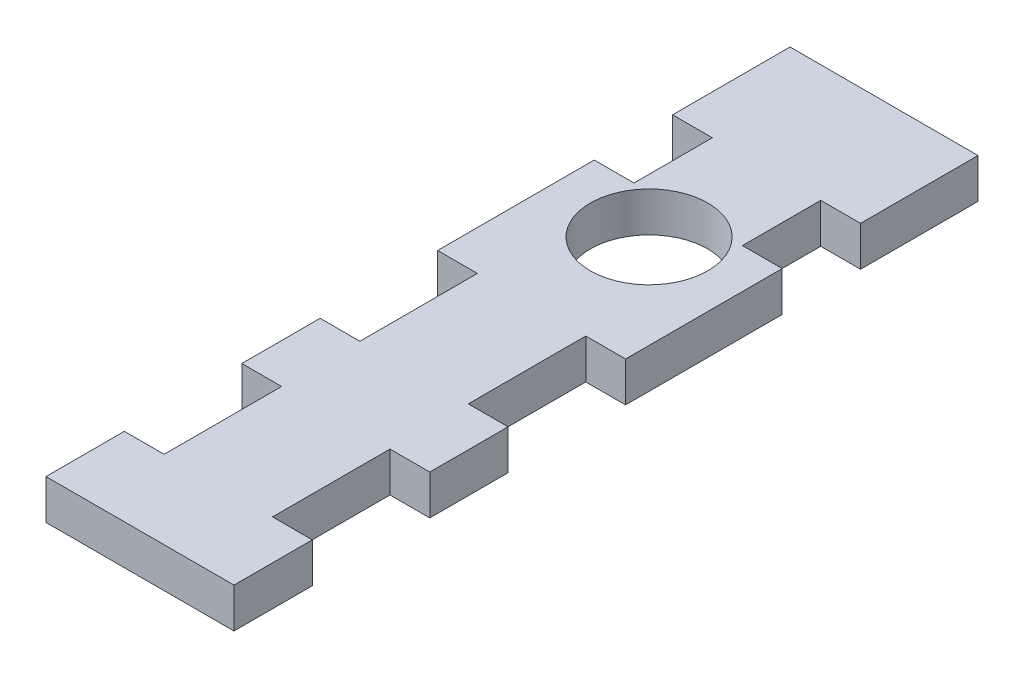
ISO-10303-21;
HEADER;
FILE_DESCRIPTION(('STEP AP214'),'2;1');
FILE_NAME('part.step','',(''),(''),'','','');
FILE_SCHEMA(('AUTOMOTIVE_DESIGN { 1 0 10303 214 1 1 1 1 }'));
ENDSEC;
DATA;
#1=APPLICATION_CONTEXT('core data for automotive mechanical design processes');
#2=APPLICATION_PROTOCOL_DEFINITION('international standard','automotive_design',2000,#1);
#3=PRODUCT_CONTEXT('',#1,'mechanical');
#4=PRODUCT('Part','Part','',(#3));
#5=PRODUCT_RELATED_PRODUCT_CATEGORY('part','',(#4));
#6=PRODUCT_DEFINITION_FORMATION('','',#4);
#7=PRODUCT_DEFINITION_CONTEXT('part definition',#1,'design');
#8=PRODUCT_DEFINITION('design','',#6,#7);
#9=PRODUCT_DEFINITION_SHAPE('','',#8);
#10=(LENGTH_UNIT() NAMED_UNIT(*) SI_UNIT(.MILLI.,.METRE.));
#11=(NAMED_UNIT(*) PLANE_ANGLE_UNIT() SI_UNIT($,.RADIAN.));
#12=(NAMED_UNIT(*) SI_UNIT($,.STERADIAN.) SOLID_ANGLE_UNIT());
#13=UNCERTAINTY_MEASURE_WITH_UNIT(LENGTH_MEASURE(1.E-05),#10,'distance_accuracy_value','');
#14=(GEOMETRIC_REPRESENTATION_CONTEXT(3) GLOBAL_UNCERTAINTY_ASSIGNED_CONTEXT((#13)) GLOBAL_UNIT_ASSIGNED_CONTEXT((#10,
#11,#12)) REPRESENTATION_CONTEXT('',''));
#15=CARTESIAN_POINT('',(0.,0.,0.));
#16=DIRECTION('',(0.,0.,1.));
#17=DIRECTION('',(1.,0.,0.));
#18=AXIS2_PLACEMENT_3D('',#15,#16,#17);
#19=CARTESIAN_POINT('',(0.,5.08,0.));
#20=DIRECTION('',(0.,-1.,0.));
#21=DIRECTION('',(0.,0.,-1.));
#22=AXIS2_PLACEMENT_3D('',#19,#20,#21);
#23=PLANE('',#22);
#24=CARTESIAN_POINT('',(0.,5.08,-32.5));
#25=DIRECTION('',(0.,1.,0.));
#26=DIRECTION('',(0.,0.,1.));
#27=AXIS2_PLACEMENT_3D('',#24,#25,#26);
#28=CIRCLE('',#27,7.5);
#29=CARTESIAN_POINT('',(0.,5.08,-25.));
#30=VERTEX_POINT('',#29);
#31=EDGE_CURVE('E381',#30,#30,#28,.T.);
#32=ORIENTED_EDGE('',*,*,#31,.F.);
#33=EDGE_LOOP('',(#32));
#34=FACE_BOUND('',#33,.T.);
#35=DIRECTION('',(-1.,0.,0.));
#36=VECTOR('',#35,1.);
#37=CARTESIAN_POINT('',(12.,5.08,-2.50000000000002));
#38=LINE('',#37,#36);
#39=CARTESIAN_POINT('',(12.,5.08,-2.50000000000002));
#40=VERTEX_POINT('',#39);
#41=CARTESIAN_POINT('',(6.92,5.08,-2.50000000000002));
#42=VERTEX_POINT('',#41);
#43=EDGE_CURVE('E247',#40,#42,#38,.T.);
#44=ORIENTED_EDGE('',*,*,#43,.T.);
#45=DIRECTION('',(0.,0.,-1.));
#46=VECTOR('',#45,1.);
#47=CARTESIAN_POINT('',(6.92,5.08,-2.50000000000002));
#48=LINE('',#47,#46);
#49=CARTESIAN_POINT('',(6.92,5.08,-17.5));
#50=VERTEX_POINT('',#49);
#51=EDGE_CURVE('E224',#42,#50,#48,.T.);
#52=ORIENTED_EDGE('',*,*,#51,.T.);
#53=DIRECTION('',(1.,0.,0.));
#54=VECTOR('',#53,1.);
#55=CARTESIAN_POINT('',(12.,5.08,-17.5));
#56=LINE('',#55,#54);
#57=CARTESIAN_POINT('',(12.,5.08,-17.5));
#58=VERTEX_POINT('',#57);
#59=EDGE_CURVE('E220',#50,#58,#56,.T.);
#60=ORIENTED_EDGE('',*,*,#59,.T.);
#61=DIRECTION('',(0.,0.,-1.));
#62=VECTOR('',#61,1.);
#63=CARTESIAN_POINT('',(12.,5.08,32.5));
#64=LINE('',#63,#62);
#65=CARTESIAN_POINT('',(12.,5.08,-37.5));
#66=VERTEX_POINT('',#65);
#67=EDGE_CURVE('E401',#58,#66,#64,.T.);
#68=ORIENTED_EDGE('',*,*,#67,.T.);
#69=DIRECTION('',(-1.,0.,0.));
#70=VECTOR('',#69,1.);
#71=CARTESIAN_POINT('',(12.,5.08,-37.5));
#72=LINE('',#71,#70);
#73=CARTESIAN_POINT('',(6.92,5.08,-37.5));
#74=VERTEX_POINT('',#73);
#75=EDGE_CURVE('E251',#66,#74,#72,.T.);
#76=ORIENTED_EDGE('',*,*,#75,.T.);
#77=DIRECTION('',(0.,0.,-1.));
#78=VECTOR('',#77,1.);
#79=CARTESIAN_POINT('',(6.92,5.08,-37.5));
#80=LINE('',#79,#78);
#81=CARTESIAN_POINT('',(6.92,5.08,-47.5));
#82=VERTEX_POINT('',#81);
#83=EDGE_CURVE('E256',#74,#82,#80,.T.);
#84=ORIENTED_EDGE('',*,*,#83,.T.);
#85=DIRECTION('',(1.,0.,0.));
#86=VECTOR('',#85,1.);
#87=CARTESIAN_POINT('',(12.,5.08,-47.5));
#88=LINE('',#87,#86);
#89=CARTESIAN_POINT('',(12.,5.08,-47.5));
#90=VERTEX_POINT('',#89);
#91=EDGE_CURVE('E260',#82,#90,#88,.T.);
#92=ORIENTED_EDGE('',*,*,#91,.T.);
#93=CARTESIAN_POINT('',(12.,5.08,-62.5));
#94=VERTEX_POINT('',#93);
#95=EDGE_CURVE('E395',#90,#94,#64,.T.);
#96=ORIENTED_EDGE('',*,*,#95,.T.);
#97=DIRECTION('',(-1.,0.,0.));
#98=VECTOR('',#97,1.);
#99=CARTESIAN_POINT('',(12.,5.08,-62.5));
#100=LINE('',#99,#98);
#101=CARTESIAN_POINT('',(-12.,5.08,-62.5));
#102=VERTEX_POINT('',#101);
#103=EDGE_CURVE('E399',#94,#102,#100,.T.);
#104=ORIENTED_EDGE('',*,*,#103,.T.);
#105=DIRECTION('',(0.,0.,1.));
#106=VECTOR('',#105,1.);
#107=CARTESIAN_POINT('',(-12.,5.08,-62.5));
#108=LINE('',#107,#106);
#109=CARTESIAN_POINT('',(-12.,5.08,-47.5));
#110=VERTEX_POINT('',#109);
#111=EDGE_CURVE('E387',#102,#110,#108,.T.);
#112=ORIENTED_EDGE('',*,*,#111,.T.);
#113=DIRECTION('',(-1.,0.,0.));
#114=VECTOR('',#113,1.);
#115=CARTESIAN_POINT('',(-12.,5.08,-47.5));
#116=LINE('',#115,#114);
#117=CARTESIAN_POINT('',(-6.92,5.08,-47.5));
#118=VERTEX_POINT('',#117);
#119=EDGE_CURVE('E328',#118,#110,#116,.T.);
#120=ORIENTED_EDGE('',*,*,#119,.F.);
#121=DIRECTION('',(0.,0.,-1.));
#122=VECTOR('',#121,1.);
#123=CARTESIAN_POINT('',(-6.92,5.08,-37.5));
#124=LINE('',#123,#122);
#125=CARTESIAN_POINT('',(-6.92,5.08,-37.5));
#126=VERTEX_POINT('',#125);
#127=EDGE_CURVE('E331',#126,#118,#124,.T.);
#128=ORIENTED_EDGE('',*,*,#127,.F.);
#129=DIRECTION('',(1.,0.,0.));
#130=VECTOR('',#129,1.);
#131=CARTESIAN_POINT('',(-12.,5.08,-37.5));
#132=LINE('',#131,#130);
#133=CARTESIAN_POINT('',(-12.,5.08,-37.5));
#134=VERTEX_POINT('',#133);
#135=EDGE_CURVE('E327',#134,#126,#132,.T.);
#136=ORIENTED_EDGE('',*,*,#135,.F.);
#137=CARTESIAN_POINT('',(-12.,5.08,-17.5));
#138=VERTEX_POINT('',#137);
#139=EDGE_CURVE('E391',#134,#138,#108,.T.);
#140=ORIENTED_EDGE('',*,*,#139,.T.);
#141=DIRECTION('',(-1.,0.,0.));
#142=VECTOR('',#141,1.);
#143=CARTESIAN_POINT('',(-12.,5.08,-17.5));
#144=LINE('',#143,#142);
#145=CARTESIAN_POINT('',(-6.92,5.08,-17.5));
#146=VERTEX_POINT('',#145);
#147=EDGE_CURVE('E302',#146,#138,#144,.T.);
#148=ORIENTED_EDGE('',*,*,#147,.F.);
#149=DIRECTION('',(0.,0.,-1.));
#150=VECTOR('',#149,1.);
#151=CARTESIAN_POINT('',(-6.92,5.08,-2.50000000000002));
#152=LINE('',#151,#150);
#153=CARTESIAN_POINT('',(-6.92,5.08,-2.50000000000002));
#154=VERTEX_POINT('',#153);
#155=EDGE_CURVE('E305',#154,#146,#152,.T.);
#156=ORIENTED_EDGE('',*,*,#155,.F.);
#157=DIRECTION('',(1.,0.,0.));
#158=VECTOR('',#157,1.);
#159=CARTESIAN_POINT('',(-12.,5.08,-2.50000000000002));
#160=LINE('',#159,#158);
#161=CARTESIAN_POINT('',(-12.,5.08,-2.50000000000002));
#162=VERTEX_POINT('',#161);
#163=EDGE_CURVE('E292',#162,#154,#160,.T.);
#164=ORIENTED_EDGE('',*,*,#163,.F.);
#165=CARTESIAN_POINT('',(-12.,5.08,7.49999999999998));
#166=VERTEX_POINT('',#165);
#167=EDGE_CURVE('E392',#162,#166,#108,.T.);
#168=ORIENTED_EDGE('',*,*,#167,.T.);
#169=DIRECTION('',(-1.,0.,0.));
#170=VECTOR('',#169,1.);
#171=CARTESIAN_POINT('',(-12.,5.08,7.49999999999998));
#172=LINE('',#171,#170);
#173=CARTESIAN_POINT('',(-6.92,5.08,7.49999999999998));
#174=VERTEX_POINT('',#173);
#175=EDGE_CURVE('E354',#174,#166,#172,.T.);
#176=ORIENTED_EDGE('',*,*,#175,.F.);
#177=DIRECTION('',(0.,0.,-1.));
#178=VECTOR('',#177,1.);
#179=CARTESIAN_POINT('',(-6.92,5.08,22.5));
#180=LINE('',#179,#178);
#181=CARTESIAN_POINT('',(-6.92,5.08,22.5));
#182=VERTEX_POINT('',#181);
#183=EDGE_CURVE('E358',#182,#174,#180,.T.);
#184=ORIENTED_EDGE('',*,*,#183,.F.);
#185=DIRECTION('',(1.,0.,0.));
#186=VECTOR('',#185,1.);
#187=CARTESIAN_POINT('',(-12.,5.08,22.5));
#188=LINE('',#187,#186);
#189=CARTESIAN_POINT('',(-12.,5.08,22.5));
#190=VERTEX_POINT('',#189);
#191=EDGE_CURVE('E353',#190,#182,#188,.T.);
#192=ORIENTED_EDGE('',*,*,#191,.F.);
#193=CARTESIAN_POINT('',(-12.,5.08,32.5));
#194=VERTEX_POINT('',#193);
#195=EDGE_CURVE('E393',#190,#194,#108,.T.);
#196=ORIENTED_EDGE('',*,*,#195,.T.);
#197=DIRECTION('',(1.,0.,0.));
#198=VECTOR('',#197,1.);
#199=CARTESIAN_POINT('',(12.,5.08,32.5));
#200=LINE('',#199,#198);
#201=CARTESIAN_POINT('',(12.,5.08,32.5));
#202=VERTEX_POINT('',#201);
#203=EDGE_CURVE('E390',#194,#202,#200,.T.);
#204=ORIENTED_EDGE('',*,*,#203,.T.);
#205=CARTESIAN_POINT('',(12.,5.08,22.5));
#206=VERTEX_POINT('',#205);
#207=EDGE_CURVE('E396',#202,#206,#64,.T.);
#208=ORIENTED_EDGE('',*,*,#207,.T.);
#209=DIRECTION('',(-1.,0.,0.));
#210=VECTOR('',#209,1.);
#211=CARTESIAN_POINT('',(12.,5.08,22.5));
#212=LINE('',#211,#210);
#213=CARTESIAN_POINT('',(6.92,5.08,22.5));
#214=VERTEX_POINT('',#213);
#215=EDGE_CURVE('E276',#206,#214,#212,.T.);
#216=ORIENTED_EDGE('',*,*,#215,.T.);
#217=DIRECTION('',(0.,0.,-1.));
#218=VECTOR('',#217,1.);
#219=CARTESIAN_POINT('',(6.92,5.08,22.5));
#220=LINE('',#219,#218);
#221=CARTESIAN_POINT('',(6.92,5.08,7.49999999999998));
#222=VERTEX_POINT('',#221);
#223=EDGE_CURVE('E281',#214,#222,#220,.T.);
#224=ORIENTED_EDGE('',*,*,#223,.T.);
#225=DIRECTION('',(1.,0.,0.));
#226=VECTOR('',#225,1.);
#227=CARTESIAN_POINT('',(12.,5.08,7.49999999999998));
#228=LINE('',#227,#226);
#229=CARTESIAN_POINT('',(12.,5.08,7.49999999999998));
#230=VERTEX_POINT('',#229);
#231=EDGE_CURVE('E285',#222,#230,#228,.T.);
#232=ORIENTED_EDGE('',*,*,#231,.T.);
#233=EDGE_CURVE('E400',#230,#40,#64,.T.);
#234=ORIENTED_EDGE('',*,*,#233,.T.);
#235=EDGE_LOOP('',(#44,#52,#60,#68,#76,#84,#92,#96,#104,#112,#120,#128,#136,#140,#148,#156,#164,
#168,#176,#184,#192,#196,#204,#208,#216,#224,#232,#234));
#236=FACE_BOUND('',#235,.T.);
#237=ADVANCED_FACE('F33',(#34,#236),#23,.F.);
#238=CARTESIAN_POINT('',(0.,0.,0.));
#239=DIRECTION('',(0.,-1.,0.));
#240=DIRECTION('',(0.,0.,-1.));
#241=AXIS2_PLACEMENT_3D('',#238,#239,#240);
#242=PLANE('',#241);
#243=CARTESIAN_POINT('',(0.,0.,-32.5));
#244=DIRECTION('',(0.,1.,0.));
#245=DIRECTION('',(0.,0.,1.));
#246=AXIS2_PLACEMENT_3D('',#243,#244,#245);
#247=CIRCLE('',#246,7.5);
#248=CARTESIAN_POINT('',(0.,0.,-25.));
#249=VERTEX_POINT('',#248);
#250=EDGE_CURVE('E380',#249,#249,#247,.T.);
#251=ORIENTED_EDGE('',*,*,#250,.T.);
#252=EDGE_LOOP('',(#251));
#253=FACE_BOUND('',#252,.T.);
#254=DIRECTION('',(0.,0.,-1.));
#255=VECTOR('',#254,1.);
#256=CARTESIAN_POINT('',(6.92,0.,-2.50000000000002));
#257=LINE('',#256,#255);
#258=CARTESIAN_POINT('',(6.92,0.,-2.50000000000002));
#259=VERTEX_POINT('',#258);
#260=CARTESIAN_POINT('',(6.92,0.,-17.5));
#261=VERTEX_POINT('',#260);
#262=EDGE_CURVE('E227',#259,#261,#257,.T.);
#263=ORIENTED_EDGE('',*,*,#262,.F.);
#264=DIRECTION('',(-1.,0.,0.));
#265=VECTOR('',#264,1.);
#266=CARTESIAN_POINT('',(12.,0.,-2.50000000000002));
#267=LINE('',#266,#265);
#268=CARTESIAN_POINT('',(12.,0.,-2.50000000000002));
#269=VERTEX_POINT('',#268);
#270=EDGE_CURVE('E234',#269,#259,#267,.T.);
#271=ORIENTED_EDGE('',*,*,#270,.F.);
#272=DIRECTION('',(0.,0.,-1.));
#273=VECTOR('',#272,1.);
#274=CARTESIAN_POINT('',(12.,0.,-32.5));
#275=LINE('',#274,#273);
#276=CARTESIAN_POINT('',(12.,0.,7.49999999999998));
#277=VERTEX_POINT('',#276);
#278=EDGE_CURVE('E417',#277,#269,#275,.T.);
#279=ORIENTED_EDGE('',*,*,#278,.F.);
#280=DIRECTION('',(1.,0.,0.));
#281=VECTOR('',#280,1.);
#282=CARTESIAN_POINT('',(12.,0.,7.49999999999998));
#283=LINE('',#282,#281);
#284=CARTESIAN_POINT('',(6.92,0.,7.49999999999998));
#285=VERTEX_POINT('',#284);
#286=EDGE_CURVE('E288',#285,#277,#283,.T.);
#287=ORIENTED_EDGE('',*,*,#286,.F.);
#288=DIRECTION('',(0.,0.,-1.));
#289=VECTOR('',#288,1.);
#290=CARTESIAN_POINT('',(6.92,0.,22.5));
#291=LINE('',#290,#289);
#292=CARTESIAN_POINT('',(6.92,0.,22.5));
#293=VERTEX_POINT('',#292);
#294=EDGE_CURVE('E289',#293,#285,#291,.T.);
#295=ORIENTED_EDGE('',*,*,#294,.F.);
#296=DIRECTION('',(-1.,0.,0.));
#297=VECTOR('',#296,1.);
#298=CARTESIAN_POINT('',(12.,0.,22.5));
#299=LINE('',#298,#297);
#300=CARTESIAN_POINT('',(12.,0.,22.5));
#301=VERTEX_POINT('',#300);
#302=EDGE_CURVE('E293',#301,#293,#299,.T.);
#303=ORIENTED_EDGE('',*,*,#302,.F.);
#304=CARTESIAN_POINT('',(12.,0.,32.5));
#305=VERTEX_POINT('',#304);
#306=EDGE_CURVE('E413',#305,#301,#275,.T.);
#307=ORIENTED_EDGE('',*,*,#306,.F.);
#308=DIRECTION('',(1.,0.,0.));
#309=VECTOR('',#308,1.);
#310=CARTESIAN_POINT('',(12.,0.,32.5));
#311=LINE('',#310,#309);
#312=CARTESIAN_POINT('',(-12.,0.,32.5));
#313=VERTEX_POINT('',#312);
#314=EDGE_CURVE('E407',#313,#305,#311,.T.);
#315=ORIENTED_EDGE('',*,*,#314,.F.);
#316=DIRECTION('',(0.,0.,1.));
#317=VECTOR('',#316,1.);
#318=CARTESIAN_POINT('',(-12.,0.,32.5));
#319=LINE('',#318,#317);
#320=CARTESIAN_POINT('',(-12.,0.,22.5));
#321=VERTEX_POINT('',#320);
#322=EDGE_CURVE('E384',#321,#313,#319,.T.);
#323=ORIENTED_EDGE('',*,*,#322,.F.);
#324=DIRECTION('',(1.,0.,0.));
#325=VECTOR('',#324,1.);
#326=CARTESIAN_POINT('',(-12.,0.,22.5));
#327=LINE('',#326,#325);
#328=CARTESIAN_POINT('',(-6.92,0.,22.5));
#329=VERTEX_POINT('',#328);
#330=EDGE_CURVE('E357',#321,#329,#327,.T.);
#331=ORIENTED_EDGE('',*,*,#330,.T.);
#332=DIRECTION('',(0.,0.,-1.));
#333=VECTOR('',#332,1.);
#334=CARTESIAN_POINT('',(-6.92,0.,22.5));
#335=LINE('',#334,#333);
#336=CARTESIAN_POINT('',(-6.92,0.,7.49999999999998));
#337=VERTEX_POINT('',#336);
#338=EDGE_CURVE('E371',#329,#337,#335,.T.);
#339=ORIENTED_EDGE('',*,*,#338,.T.);
#340=DIRECTION('',(-1.,0.,0.));
#341=VECTOR('',#340,1.);
#342=CARTESIAN_POINT('',(-12.,0.,7.49999999999998));
#343=LINE('',#342,#341);
#344=CARTESIAN_POINT('',(-12.,0.,7.49999999999998));
#345=VERTEX_POINT('',#344);
#346=EDGE_CURVE('E366',#337,#345,#343,.T.);
#347=ORIENTED_EDGE('',*,*,#346,.T.);
#348=CARTESIAN_POINT('',(-12.,0.,-2.50000000000002));
#349=VERTEX_POINT('',#348);
#350=EDGE_CURVE('E409',#349,#345,#319,.T.);
#351=ORIENTED_EDGE('',*,*,#350,.F.);
#352=DIRECTION('',(1.,0.,0.));
#353=VECTOR('',#352,1.);
#354=CARTESIAN_POINT('',(-12.,0.,-2.50000000000002));
#355=LINE('',#354,#353);
#356=CARTESIAN_POINT('',(-6.92,0.,-2.50000000000002));
#357=VERTEX_POINT('',#356);
#358=EDGE_CURVE('E304',#349,#357,#355,.T.);
#359=ORIENTED_EDGE('',*,*,#358,.T.);
#360=DIRECTION('',(0.,0.,-1.));
#361=VECTOR('',#360,1.);
#362=CARTESIAN_POINT('',(-6.92,0.,-2.50000000000002));
#363=LINE('',#362,#361);
#364=CARTESIAN_POINT('',(-6.92,0.,-17.5));
#365=VERTEX_POINT('',#364);
#366=EDGE_CURVE('E318',#357,#365,#363,.T.);
#367=ORIENTED_EDGE('',*,*,#366,.T.);
#368=DIRECTION('',(-1.,0.,0.));
#369=VECTOR('',#368,1.);
#370=CARTESIAN_POINT('',(-12.,0.,-17.5));
#371=LINE('',#370,#369);
#372=CARTESIAN_POINT('',(-12.,0.,-17.5));
#373=VERTEX_POINT('',#372);
#374=EDGE_CURVE('E313',#365,#373,#371,.T.);
#375=ORIENTED_EDGE('',*,*,#374,.T.);
#376=CARTESIAN_POINT('',(-12.,0.,-37.5));
#377=VERTEX_POINT('',#376);
#378=EDGE_CURVE('E408',#377,#373,#319,.T.);
#379=ORIENTED_EDGE('',*,*,#378,.F.);
#380=DIRECTION('',(1.,0.,0.));
#381=VECTOR('',#380,1.);
#382=CARTESIAN_POINT('',(-12.,0.,-37.5));
#383=LINE('',#382,#381);
#384=CARTESIAN_POINT('',(-6.92,0.,-37.5));
#385=VERTEX_POINT('',#384);
#386=EDGE_CURVE('E330',#377,#385,#383,.T.);
#387=ORIENTED_EDGE('',*,*,#386,.T.);
#388=DIRECTION('',(0.,0.,-1.));
#389=VECTOR('',#388,1.);
#390=CARTESIAN_POINT('',(-6.92,0.,-37.5));
#391=LINE('',#390,#389);
#392=CARTESIAN_POINT('',(-6.92,0.,-47.5));
#393=VERTEX_POINT('',#392);
#394=EDGE_CURVE('E344',#385,#393,#391,.T.);
#395=ORIENTED_EDGE('',*,*,#394,.T.);
#396=DIRECTION('',(-1.,0.,0.));
#397=VECTOR('',#396,1.);
#398=CARTESIAN_POINT('',(-12.,0.,-47.5));
#399=LINE('',#398,#397);
#400=CARTESIAN_POINT('',(-12.,0.,-47.5));
#401=VERTEX_POINT('',#400);
#402=EDGE_CURVE('E339',#393,#401,#399,.T.);
#403=ORIENTED_EDGE('',*,*,#402,.T.);
#404=CARTESIAN_POINT('',(-12.,0.,-62.5));
#405=VERTEX_POINT('',#404);
#406=EDGE_CURVE('E404',#405,#401,#319,.T.);
#407=ORIENTED_EDGE('',*,*,#406,.F.);
#408=DIRECTION('',(-1.,0.,0.));
#409=VECTOR('',#408,1.);
#410=CARTESIAN_POINT('',(12.,0.,-62.5));
#411=LINE('',#410,#409);
#412=CARTESIAN_POINT('',(12.,0.,-62.5));
#413=VERTEX_POINT('',#412);
#414=EDGE_CURVE('E416',#413,#405,#411,.T.);
#415=ORIENTED_EDGE('',*,*,#414,.F.);
#416=CARTESIAN_POINT('',(12.,0.,-47.5));
#417=VERTEX_POINT('',#416);
#418=EDGE_CURVE('E412',#417,#413,#275,.T.);
#419=ORIENTED_EDGE('',*,*,#418,.F.);
#420=DIRECTION('',(1.,0.,0.));
#421=VECTOR('',#420,1.);
#422=CARTESIAN_POINT('',(12.,0.,-47.5));
#423=LINE('',#422,#421);
#424=CARTESIAN_POINT('',(6.92,0.,-47.5));
#425=VERTEX_POINT('',#424);
#426=EDGE_CURVE('E56',#425,#417,#423,.T.);
#427=ORIENTED_EDGE('',*,*,#426,.F.);
#428=DIRECTION('',(0.,0.,-1.));
#429=VECTOR('',#428,1.);
#430=CARTESIAN_POINT('',(6.92,0.,-37.5));
#431=LINE('',#430,#429);
#432=CARTESIAN_POINT('',(6.92,0.,-37.5));
#433=VERTEX_POINT('',#432);
#434=EDGE_CURVE('E263',#433,#425,#431,.T.);
#435=ORIENTED_EDGE('',*,*,#434,.F.);
#436=DIRECTION('',(-1.,0.,0.));
#437=VECTOR('',#436,1.);
#438=CARTESIAN_POINT('',(12.,0.,-37.5));
#439=LINE('',#438,#437);
#440=CARTESIAN_POINT('',(12.,0.,-37.5));
#441=VERTEX_POINT('',#440);
#442=EDGE_CURVE('E267',#441,#433,#439,.T.);
#443=ORIENTED_EDGE('',*,*,#442,.F.);
#444=CARTESIAN_POINT('',(12.,0.,-17.5));
#445=VERTEX_POINT('',#444);
#446=EDGE_CURVE('E239',#445,#441,#275,.T.);
#447=ORIENTED_EDGE('',*,*,#446,.F.);
#448=DIRECTION('',(1.,0.,0.));
#449=VECTOR('',#448,1.);
#450=CARTESIAN_POINT('',(12.,0.,-17.5));
#451=LINE('',#450,#449);
#452=EDGE_CURVE('E48',#261,#445,#451,.T.);
#453=ORIENTED_EDGE('',*,*,#452,.F.);
#454=EDGE_LOOP('',(#263,#271,#279,#287,#295,#303,#307,#315,#323,#331,#339,#347,#351,#359,#367,
#375,#379,#387,#395,#403,#407,#415,#419,#427,#435,#443,#447,#453));
#455=FACE_BOUND('',#454,.T.);
#456=ADVANCED_FACE('F237',(#253,#455),#242,.T.);
#457=CARTESIAN_POINT('',(12.,5.08,-32.5));
#458=DIRECTION('',(-1.,0.,0.));
#459=DIRECTION('',(0.,0.,1.));
#460=AXIS2_PLACEMENT_3D('',#457,#458,#459);
#461=PLANE('',#460);
#462=DIRECTION('',(0.,1.,0.));
#463=VECTOR('',#462,1.);
#464=CARTESIAN_POINT('',(12.,-15.8368683773024,-2.50000000000002));
#465=LINE('',#464,#463);
#466=EDGE_CURVE('E244',#269,#40,#465,.T.);
#467=ORIENTED_EDGE('',*,*,#466,.T.);
#468=ORIENTED_EDGE('',*,*,#233,.F.);
#469=DIRECTION('',(0.,1.,0.));
#470=VECTOR('',#469,1.);
#471=CARTESIAN_POINT('',(12.,-15.8368683773024,7.49999999999998));
#472=LINE('',#471,#470);
#473=EDGE_CURVE('E266',#277,#230,#472,.T.);
#474=ORIENTED_EDGE('',*,*,#473,.F.);
#475=ORIENTED_EDGE('',*,*,#278,.T.);
#476=EDGE_LOOP('',(#467,#468,#474,#475));
#477=FACE_BOUND('',#476,.T.);
#478=ADVANCED_FACE('F499',(#477),#461,.F.);
#479=DIRECTION('',(0.,1.,0.));
#480=VECTOR('',#479,1.);
#481=CARTESIAN_POINT('',(12.,-15.8368683773024,-17.5));
#482=LINE('',#481,#480);
#483=EDGE_CURVE('E248',#445,#58,#482,.T.);
#484=ORIENTED_EDGE('',*,*,#483,.F.);
#485=ORIENTED_EDGE('',*,*,#446,.T.);
#486=DIRECTION('',(0.,1.,0.));
#487=VECTOR('',#486,1.);
#488=CARTESIAN_POINT('',(12.,-15.8368683773024,-37.5));
#489=LINE('',#488,#487);
#490=EDGE_CURVE('E255',#441,#66,#489,.T.);
#491=ORIENTED_EDGE('',*,*,#490,.T.);
#492=ORIENTED_EDGE('',*,*,#67,.F.);
#493=EDGE_LOOP('',(#484,#485,#491,#492));
#494=FACE_BOUND('',#493,.T.);
#495=ADVANCED_FACE('F632',(#494),#461,.F.);
#496=DIRECTION('',(0.,1.,0.));
#497=VECTOR('',#496,1.);
#498=CARTESIAN_POINT('',(12.,-15.8368683773024,-47.5));
#499=LINE('',#498,#497);
#500=EDGE_CURVE('E233',#417,#90,#499,.T.);
#501=ORIENTED_EDGE('',*,*,#500,.F.);
#502=ORIENTED_EDGE('',*,*,#418,.T.);
#503=DIRECTION('',(0.,-1.,0.));
#504=VECTOR('',#503,1.);
#505=CARTESIAN_POINT('',(12.,5.08,-62.5));
#506=LINE('',#505,#504);
#507=EDGE_CURVE('E422',#94,#413,#506,.T.);
#508=ORIENTED_EDGE('',*,*,#507,.F.);
#509=ORIENTED_EDGE('',*,*,#95,.F.);
#510=EDGE_LOOP('',(#501,#502,#508,#509));
#511=FACE_BOUND('',#510,.T.);
#512=ADVANCED_FACE('F508',(#511),#461,.F.);
#513=DIRECTION('',(0.,1.,0.));
#514=VECTOR('',#513,1.);
#515=CARTESIAN_POINT('',(12.,-15.8368683773024,22.5));
#516=LINE('',#515,#514);
#517=EDGE_CURVE('E280',#301,#206,#516,.T.);
#518=ORIENTED_EDGE('',*,*,#517,.T.);
#519=ORIENTED_EDGE('',*,*,#207,.F.);
#520=DIRECTION('',(0.,-1.,0.));
#521=VECTOR('',#520,1.);
#522=CARTESIAN_POINT('',(12.,5.08,32.5));
#523=LINE('',#522,#521);
#524=EDGE_CURVE('E41',#202,#305,#523,.T.);
#525=ORIENTED_EDGE('',*,*,#524,.T.);
#526=ORIENTED_EDGE('',*,*,#306,.T.);
#527=EDGE_LOOP('',(#518,#519,#525,#526));
#528=FACE_BOUND('',#527,.T.);
#529=ADVANCED_FACE('F428',(#528),#461,.F.);
#530=CARTESIAN_POINT('',(-12.,5.08,32.5));
#531=DIRECTION('',(1.,0.,0.));
#532=DIRECTION('',(0.,0.,-1.));
#533=AXIS2_PLACEMENT_3D('',#530,#531,#532);
#534=PLANE('',#533);
#535=ORIENTED_EDGE('',*,*,#167,.F.);
#536=DIRECTION('',(0.,1.,0.));
#537=VECTOR('',#536,1.);
#538=CARTESIAN_POINT('',(-12.,-15.8368683773024,-2.50000000000002));
#539=LINE('',#538,#537);
#540=EDGE_CURVE('E323',#349,#162,#539,.T.);
#541=ORIENTED_EDGE('',*,*,#540,.F.);
#542=ORIENTED_EDGE('',*,*,#350,.T.);
#543=DIRECTION('',(0.,1.,0.));
#544=VECTOR('',#543,1.);
#545=CARTESIAN_POINT('',(-12.,-15.8368683773024,7.49999999999998));
#546=LINE('',#545,#544);
#547=EDGE_CURVE('E369',#345,#166,#546,.T.);
#548=ORIENTED_EDGE('',*,*,#547,.T.);
#549=EDGE_LOOP('',(#535,#541,#542,#548));
#550=FACE_BOUND('',#549,.T.);
#551=ADVANCED_FACE('F475',(#550),#534,.F.);
#552=ORIENTED_EDGE('',*,*,#378,.T.);
#553=DIRECTION('',(0.,1.,0.));
#554=VECTOR('',#553,1.);
#555=CARTESIAN_POINT('',(-12.,-15.8368683773024,-17.5));
#556=LINE('',#555,#554);
#557=EDGE_CURVE('E316',#373,#138,#556,.T.);
#558=ORIENTED_EDGE('',*,*,#557,.T.);
#559=ORIENTED_EDGE('',*,*,#139,.F.);
#560=DIRECTION('',(0.,1.,0.));
#561=VECTOR('',#560,1.);
#562=CARTESIAN_POINT('',(-12.,-15.8368683773024,-37.5));
#563=LINE('',#562,#561);
#564=EDGE_CURVE('E349',#377,#134,#563,.T.);
#565=ORIENTED_EDGE('',*,*,#564,.F.);
#566=EDGE_LOOP('',(#552,#558,#559,#565));
#567=FACE_BOUND('',#566,.T.);
#568=ADVANCED_FACE('F453',(#567),#534,.F.);
#569=ORIENTED_EDGE('',*,*,#195,.F.);
#570=DIRECTION('',(0.,1.,0.));
#571=VECTOR('',#570,1.);
#572=CARTESIAN_POINT('',(-12.,-15.8368683773024,22.5));
#573=LINE('',#572,#571);
#574=EDGE_CURVE('E376',#321,#190,#573,.T.);
#575=ORIENTED_EDGE('',*,*,#574,.F.);
#576=ORIENTED_EDGE('',*,*,#322,.T.);
#577=DIRECTION('',(0.,-1.,0.));
#578=VECTOR('',#577,1.);
#579=CARTESIAN_POINT('',(-12.,5.08,32.5));
#580=LINE('',#579,#578);
#581=EDGE_CURVE('E11',#194,#313,#580,.T.);
#582=ORIENTED_EDGE('',*,*,#581,.F.);
#583=EDGE_LOOP('',(#569,#575,#576,#582));
#584=FACE_BOUND('',#583,.T.);
#585=ADVANCED_FACE('F448',(#584),#534,.F.);
#586=ORIENTED_EDGE('',*,*,#406,.T.);
#587=DIRECTION('',(0.,1.,0.));
#588=VECTOR('',#587,1.);
#589=CARTESIAN_POINT('',(-12.,-15.8368683773024,-47.5));
#590=LINE('',#589,#588);
#591=EDGE_CURVE('E342',#401,#110,#590,.T.);
#592=ORIENTED_EDGE('',*,*,#591,.T.);
#593=ORIENTED_EDGE('',*,*,#111,.F.);
#594=DIRECTION('',(0.,-1.,0.));
#595=VECTOR('',#594,1.);
#596=CARTESIAN_POINT('',(-12.,5.08,-62.5));
#597=LINE('',#596,#595);
#598=EDGE_CURVE('E403',#102,#405,#597,.T.);
#599=ORIENTED_EDGE('',*,*,#598,.T.);
#600=EDGE_LOOP('',(#586,#592,#593,#599));
#601=FACE_BOUND('',#600,.T.);
#602=ADVANCED_FACE('F35',(#601),#534,.F.);
#603=CARTESIAN_POINT('',(12.,5.08,32.5));
#604=DIRECTION('',(0.,0.,-1.));
#605=DIRECTION('',(-1.,0.,0.));
#606=AXIS2_PLACEMENT_3D('',#603,#604,#605);
#607=PLANE('',#606);
#608=ORIENTED_EDGE('',*,*,#314,.T.);
#609=ORIENTED_EDGE('',*,*,#524,.F.);
#610=ORIENTED_EDGE('',*,*,#203,.F.);
#611=ORIENTED_EDGE('',*,*,#581,.T.);
#612=EDGE_LOOP('',(#608,#609,#610,#611));
#613=FACE_BOUND('',#612,.T.);
#614=ADVANCED_FACE('F431',(#613),#607,.F.);
#615=CARTESIAN_POINT('',(12.,5.08,-62.5));
#616=DIRECTION('',(0.,0.,1.));
#617=DIRECTION('',(1.,0.,0.));
#618=AXIS2_PLACEMENT_3D('',#615,#616,#617);
#619=PLANE('',#618);
#620=ORIENTED_EDGE('',*,*,#414,.T.);
#621=ORIENTED_EDGE('',*,*,#598,.F.);
#622=ORIENTED_EDGE('',*,*,#103,.F.);
#623=ORIENTED_EDGE('',*,*,#507,.T.);
#624=EDGE_LOOP('',(#620,#621,#622,#623));
#625=FACE_BOUND('',#624,.T.);
#626=ADVANCED_FACE('F490',(#625),#619,.F.);
#627=CARTESIAN_POINT('',(0.,5.08,-32.5));
#628=DIRECTION('',(0.,-1.,0.));
#629=DIRECTION('',(0.,0.,-1.));
#630=AXIS2_PLACEMENT_3D('',#627,#628,#629);
#631=CYLINDRICAL_SURFACE('',#630,7.5);
#632=ORIENTED_EDGE('',*,*,#31,.T.);
#633=EDGE_LOOP('',(#632));
#634=FACE_BOUND('',#633,.T.);
#635=ORIENTED_EDGE('',*,*,#250,.F.);
#636=EDGE_LOOP('',(#635));
#637=FACE_BOUND('',#636,.T.);
#638=ADVANCED_FACE('F483',(#634,#637),#631,.F.);
#639=CARTESIAN_POINT('',(-12.,-15.8368683773024,22.5));
#640=DIRECTION('',(0.,0.,1.));
#641=DIRECTION('',(1.,0.,0.));
#642=AXIS2_PLACEMENT_3D('',#639,#640,#641);
#643=PLANE('',#642);
#644=ORIENTED_EDGE('',*,*,#574,.T.);
#645=ORIENTED_EDGE('',*,*,#191,.T.);
#646=DIRECTION('',(0.,1.,0.));
#647=VECTOR('',#646,1.);
#648=CARTESIAN_POINT('',(-6.92,-15.8368683773024,22.5));
#649=LINE('',#648,#647);
#650=EDGE_CURVE('E365',#329,#182,#649,.T.);
#651=ORIENTED_EDGE('',*,*,#650,.F.);
#652=ORIENTED_EDGE('',*,*,#330,.F.);
#653=EDGE_LOOP('',(#644,#645,#651,#652));
#654=FACE_BOUND('',#653,.T.);
#655=ADVANCED_FACE('F481',(#654),#643,.F.);
#656=CARTESIAN_POINT('',(-6.92,-15.8368683773024,22.5));
#657=DIRECTION('',(1.,0.,0.));
#658=DIRECTION('',(0.,0.,-1.));
#659=AXIS2_PLACEMENT_3D('',#656,#657,#658);
#660=PLANE('',#659);
#661=ORIENTED_EDGE('',*,*,#650,.T.);
#662=ORIENTED_EDGE('',*,*,#183,.T.);
#663=DIRECTION('',(0.,1.,0.));
#664=VECTOR('',#663,1.);
#665=CARTESIAN_POINT('',(-6.92,-15.8368683773024,7.49999999999998));
#666=LINE('',#665,#664);
#667=EDGE_CURVE('E370',#337,#174,#666,.T.);
#668=ORIENTED_EDGE('',*,*,#667,.F.);
#669=ORIENTED_EDGE('',*,*,#338,.F.);
#670=EDGE_LOOP('',(#661,#662,#668,#669));
#671=FACE_BOUND('',#670,.T.);
#672=ADVANCED_FACE('F478',(#671),#660,.F.);
#673=CARTESIAN_POINT('',(-12.,-15.8368683773024,7.49999999999998));
#674=DIRECTION('',(0.,0.,-1.));
#675=DIRECTION('',(-1.,0.,0.));
#676=AXIS2_PLACEMENT_3D('',#673,#674,#675);
#677=PLANE('',#676);
#678=ORIENTED_EDGE('',*,*,#667,.T.);
#679=ORIENTED_EDGE('',*,*,#175,.T.);
#680=ORIENTED_EDGE('',*,*,#547,.F.);
#681=ORIENTED_EDGE('',*,*,#346,.F.);
#682=EDGE_LOOP('',(#678,#679,#680,#681));
#683=FACE_BOUND('',#682,.T.);
#684=ADVANCED_FACE('F473',(#683),#677,.F.);
#685=CARTESIAN_POINT('',(-12.,-15.8368683773024,-37.5));
#686=DIRECTION('',(0.,0.,1.));
#687=DIRECTION('',(1.,0.,0.));
#688=AXIS2_PLACEMENT_3D('',#685,#686,#687);
#689=PLANE('',#688);
#690=ORIENTED_EDGE('',*,*,#564,.T.);
#691=ORIENTED_EDGE('',*,*,#135,.T.);
#692=DIRECTION('',(0.,1.,0.));
#693=VECTOR('',#692,1.);
#694=CARTESIAN_POINT('',(-6.92,-15.8368683773024,-37.5));
#695=LINE('',#694,#693);
#696=EDGE_CURVE('E338',#385,#126,#695,.T.);
#697=ORIENTED_EDGE('',*,*,#696,.F.);
#698=ORIENTED_EDGE('',*,*,#386,.F.);
#699=EDGE_LOOP('',(#690,#691,#697,#698));
#700=FACE_BOUND('',#699,.T.);
#701=ADVANCED_FACE('F555',(#700),#689,.F.);
#702=CARTESIAN_POINT('',(-6.92,-15.8368683773024,-37.5));
#703=DIRECTION('',(1.,0.,0.));
#704=DIRECTION('',(0.,0.,-1.));
#705=AXIS2_PLACEMENT_3D('',#702,#703,#704);
#706=PLANE('',#705);
#707=ORIENTED_EDGE('',*,*,#696,.T.);
#708=ORIENTED_EDGE('',*,*,#127,.T.);
#709=DIRECTION('',(0.,1.,0.));
#710=VECTOR('',#709,1.);
#711=CARTESIAN_POINT('',(-6.92,-15.8368683773024,-47.5));
#712=LINE('',#711,#710);
#713=EDGE_CURVE('E343',#393,#118,#712,.T.);
#714=ORIENTED_EDGE('',*,*,#713,.F.);
#715=ORIENTED_EDGE('',*,*,#394,.F.);
#716=EDGE_LOOP('',(#707,#708,#714,#715));
#717=FACE_BOUND('',#716,.T.);
#718=ADVANCED_FACE('F564',(#717),#706,.F.);
#719=CARTESIAN_POINT('',(-12.,-15.8368683773024,-47.5));
#720=DIRECTION('',(0.,0.,-1.));
#721=DIRECTION('',(-1.,0.,0.));
#722=AXIS2_PLACEMENT_3D('',#719,#720,#721);
#723=PLANE('',#722);
#724=ORIENTED_EDGE('',*,*,#713,.T.);
#725=ORIENTED_EDGE('',*,*,#119,.T.);
#726=ORIENTED_EDGE('',*,*,#591,.F.);
#727=ORIENTED_EDGE('',*,*,#402,.F.);
#728=EDGE_LOOP('',(#724,#725,#726,#727));
#729=FACE_BOUND('',#728,.T.);
#730=ADVANCED_FACE('F574',(#729),#723,.F.);
#731=CARTESIAN_POINT('',(-12.,-15.8368683773024,-2.50000000000002));
#732=DIRECTION('',(0.,0.,1.));
#733=DIRECTION('',(1.,0.,0.));
#734=AXIS2_PLACEMENT_3D('',#731,#732,#733);
#735=PLANE('',#734);
#736=ORIENTED_EDGE('',*,*,#540,.T.);
#737=ORIENTED_EDGE('',*,*,#163,.T.);
#738=DIRECTION('',(0.,1.,0.));
#739=VECTOR('',#738,1.);
#740=CARTESIAN_POINT('',(-6.92,-15.8368683773024,-2.50000000000002));
#741=LINE('',#740,#739);
#742=EDGE_CURVE('E312',#357,#154,#741,.T.);
#743=ORIENTED_EDGE('',*,*,#742,.F.);
#744=ORIENTED_EDGE('',*,*,#358,.F.);
#745=EDGE_LOOP('',(#736,#737,#743,#744));
#746=FACE_BOUND('',#745,.T.);
#747=ADVANCED_FACE('F584',(#746),#735,.F.);
#748=CARTESIAN_POINT('',(-6.92,-15.8368683773024,-2.50000000000002));
#749=DIRECTION('',(1.,0.,0.));
#750=DIRECTION('',(0.,0.,-1.));
#751=AXIS2_PLACEMENT_3D('',#748,#749,#750);
#752=PLANE('',#751);
#753=ORIENTED_EDGE('',*,*,#742,.T.);
#754=ORIENTED_EDGE('',*,*,#155,.T.);
#755=DIRECTION('',(0.,1.,0.));
#756=VECTOR('',#755,1.);
#757=CARTESIAN_POINT('',(-6.92,-15.8368683773024,-17.5));
#758=LINE('',#757,#756);
#759=EDGE_CURVE('E317',#365,#146,#758,.T.);
#760=ORIENTED_EDGE('',*,*,#759,.F.);
#761=ORIENTED_EDGE('',*,*,#366,.F.);
#762=EDGE_LOOP('',(#753,#754,#760,#761));
#763=FACE_BOUND('',#762,.T.);
#764=ADVANCED_FACE('F460',(#763),#752,.F.);
#765=CARTESIAN_POINT('',(-12.,-15.8368683773024,-17.5));
#766=DIRECTION('',(0.,0.,-1.));
#767=DIRECTION('',(-1.,0.,0.));
#768=AXIS2_PLACEMENT_3D('',#765,#766,#767);
#769=PLANE('',#768);
#770=ORIENTED_EDGE('',*,*,#759,.T.);
#771=ORIENTED_EDGE('',*,*,#147,.T.);
#772=ORIENTED_EDGE('',*,*,#557,.F.);
#773=ORIENTED_EDGE('',*,*,#374,.F.);
#774=EDGE_LOOP('',(#770,#771,#772,#773));
#775=FACE_BOUND('',#774,.T.);
#776=ADVANCED_FACE('F458',(#775),#769,.F.);
#777=CARTESIAN_POINT('',(12.,-15.8368683773024,22.5));
#778=DIRECTION('',(0.,0.,-1.));
#779=DIRECTION('',(-1.,0.,0.));
#780=AXIS2_PLACEMENT_3D('',#777,#778,#779);
#781=PLANE('',#780);
#782=ORIENTED_EDGE('',*,*,#302,.T.);
#783=DIRECTION('',(0.,1.,0.));
#784=VECTOR('',#783,1.);
#785=CARTESIAN_POINT('',(6.92,-15.8368683773024,22.5));
#786=LINE('',#785,#784);
#787=EDGE_CURVE('E279',#293,#214,#786,.T.);
#788=ORIENTED_EDGE('',*,*,#787,.T.);
#789=ORIENTED_EDGE('',*,*,#215,.F.);
#790=ORIENTED_EDGE('',*,*,#517,.F.);
#791=EDGE_LOOP('',(#782,#788,#789,#790));
#792=FACE_BOUND('',#791,.T.);
#793=ADVANCED_FACE('F439',(#792),#781,.T.);
#794=CARTESIAN_POINT('',(6.92,-15.8368683773024,22.5));
#795=DIRECTION('',(1.,0.,0.));
#796=DIRECTION('',(0.,0.,-1.));
#797=AXIS2_PLACEMENT_3D('',#794,#795,#796);
#798=PLANE('',#797);
#799=ORIENTED_EDGE('',*,*,#294,.T.);
#800=DIRECTION('',(0.,1.,0.));
#801=VECTOR('',#800,1.);
#802=CARTESIAN_POINT('',(6.92,-15.8368683773024,7.49999999999998));
#803=LINE('',#802,#801);
#804=EDGE_CURVE('E284',#285,#222,#803,.T.);
#805=ORIENTED_EDGE('',*,*,#804,.T.);
#806=ORIENTED_EDGE('',*,*,#223,.F.);
#807=ORIENTED_EDGE('',*,*,#787,.F.);
#808=EDGE_LOOP('',(#799,#805,#806,#807));
#809=FACE_BOUND('',#808,.T.);
#810=ADVANCED_FACE('F664',(#809),#798,.T.);
#811=CARTESIAN_POINT('',(12.,-15.8368683773024,7.49999999999998));
#812=DIRECTION('',(0.,0.,1.));
#813=DIRECTION('',(1.,0.,0.));
#814=AXIS2_PLACEMENT_3D('',#811,#812,#813);
#815=PLANE('',#814);
#816=ORIENTED_EDGE('',*,*,#286,.T.);
#817=ORIENTED_EDGE('',*,*,#473,.T.);
#818=ORIENTED_EDGE('',*,*,#231,.F.);
#819=ORIENTED_EDGE('',*,*,#804,.F.);
#820=EDGE_LOOP('',(#816,#817,#818,#819));
#821=FACE_BOUND('',#820,.T.);
#822=ADVANCED_FACE('F673',(#821),#815,.T.);
#823=CARTESIAN_POINT('',(12.,-15.8368683773024,-37.5));
#824=DIRECTION('',(0.,0.,-1.));
#825=DIRECTION('',(-1.,0.,0.));
#826=AXIS2_PLACEMENT_3D('',#823,#824,#825);
#827=PLANE('',#826);
#828=ORIENTED_EDGE('',*,*,#442,.T.);
#829=DIRECTION('',(0.,1.,0.));
#830=VECTOR('',#829,1.);
#831=CARTESIAN_POINT('',(6.92,-15.8368683773024,-37.5));
#832=LINE('',#831,#830);
#833=EDGE_CURVE('E254',#433,#74,#832,.T.);
#834=ORIENTED_EDGE('',*,*,#833,.T.);
#835=ORIENTED_EDGE('',*,*,#75,.F.);
#836=ORIENTED_EDGE('',*,*,#490,.F.);
#837=EDGE_LOOP('',(#828,#834,#835,#836));
#838=FACE_BOUND('',#837,.T.);
#839=ADVANCED_FACE('F683',(#838),#827,.T.);
#840=CARTESIAN_POINT('',(6.92,-15.8368683773024,-37.5));
#841=DIRECTION('',(1.,0.,0.));
#842=DIRECTION('',(0.,0.,-1.));
#843=AXIS2_PLACEMENT_3D('',#840,#841,#842);
#844=PLANE('',#843);
#845=ORIENTED_EDGE('',*,*,#434,.T.);
#846=DIRECTION('',(0.,1.,0.));
#847=VECTOR('',#846,1.);
#848=CARTESIAN_POINT('',(6.92,-15.8368683773024,-47.5));
#849=LINE('',#848,#847);
#850=EDGE_CURVE('E259',#425,#82,#849,.T.);
#851=ORIENTED_EDGE('',*,*,#850,.T.);
#852=ORIENTED_EDGE('',*,*,#83,.F.);
#853=ORIENTED_EDGE('',*,*,#833,.F.);
#854=EDGE_LOOP('',(#845,#851,#852,#853));
#855=FACE_BOUND('',#854,.T.);
#856=ADVANCED_FACE('F693',(#855),#844,.T.);
#857=CARTESIAN_POINT('',(12.,-15.8368683773024,-47.5));
#858=DIRECTION('',(0.,0.,1.));
#859=DIRECTION('',(1.,0.,0.));
#860=AXIS2_PLACEMENT_3D('',#857,#858,#859);
#861=PLANE('',#860);
#862=ORIENTED_EDGE('',*,*,#426,.T.);
#863=ORIENTED_EDGE('',*,*,#500,.T.);
#864=ORIENTED_EDGE('',*,*,#91,.F.);
#865=ORIENTED_EDGE('',*,*,#850,.F.);
#866=EDGE_LOOP('',(#862,#863,#864,#865));
#867=FACE_BOUND('',#866,.T.);
#868=ADVANCED_FACE('F703',(#867),#861,.T.);
#869=CARTESIAN_POINT('',(12.,-15.8368683773024,-2.50000000000002));
#870=DIRECTION('',(0.,0.,-1.));
#871=DIRECTION('',(-1.,0.,0.));
#872=AXIS2_PLACEMENT_3D('',#869,#870,#871);
#873=PLANE('',#872);
#874=ORIENTED_EDGE('',*,*,#270,.T.);
#875=DIRECTION('',(0.,1.,0.));
#876=VECTOR('',#875,1.);
#877=CARTESIAN_POINT('',(6.92,-15.8368683773024,-2.50000000000002));
#878=LINE('',#877,#876);
#879=EDGE_CURVE('E229',#259,#42,#878,.T.);
#880=ORIENTED_EDGE('',*,*,#879,.T.);
#881=ORIENTED_EDGE('',*,*,#43,.F.);
#882=ORIENTED_EDGE('',*,*,#466,.F.);
#883=EDGE_LOOP('',(#874,#880,#881,#882));
#884=FACE_BOUND('',#883,.T.);
#885=ADVANCED_FACE('F713',(#884),#873,.T.);
#886=CARTESIAN_POINT('',(6.92,-15.8368683773024,-2.50000000000002));
#887=DIRECTION('',(1.,0.,0.));
#888=DIRECTION('',(0.,0.,-1.));
#889=AXIS2_PLACEMENT_3D('',#886,#887,#888);
#890=PLANE('',#889);
#891=ORIENTED_EDGE('',*,*,#262,.T.);
#892=DIRECTION('',(0.,1.,0.));
#893=VECTOR('',#892,1.);
#894=CARTESIAN_POINT('',(6.92,-15.8368683773024,-17.5));
#895=LINE('',#894,#893);
#896=EDGE_CURVE('E216',#261,#50,#895,.T.);
#897=ORIENTED_EDGE('',*,*,#896,.T.);
#898=ORIENTED_EDGE('',*,*,#51,.F.);
#899=ORIENTED_EDGE('',*,*,#879,.F.);
#900=EDGE_LOOP('',(#891,#897,#898,#899));
#901=FACE_BOUND('',#900,.T.);
#902=ADVANCED_FACE('F228',(#901),#890,.T.);
#903=CARTESIAN_POINT('',(12.,-15.8368683773024,-17.5));
#904=DIRECTION('',(0.,0.,1.));
#905=DIRECTION('',(1.,0.,0.));
#906=AXIS2_PLACEMENT_3D('',#903,#904,#905);
#907=PLANE('',#906);
#908=ORIENTED_EDGE('',*,*,#452,.T.);
#909=ORIENTED_EDGE('',*,*,#483,.T.);
#910=ORIENTED_EDGE('',*,*,#59,.F.);
#911=ORIENTED_EDGE('',*,*,#896,.F.);
#912=EDGE_LOOP('',(#908,#909,#910,#911));
#913=FACE_BOUND('',#912,.T.);
#914=ADVANCED_FACE('F218',(#913),#907,.T.);
#915=CLOSED_SHELL('',(#237,#456,#478,#495,#512,#529,#551,#568,#585,#602,#614,#626,#638,#655,
#672,#684,#701,#718,#730,#747,#764,#776,#793,#810,#822,#839,#856,#868,#885,#902,#914));
#916=MANIFOLD_SOLID_BREP('B2',#915);
#917=ADVANCED_BREP_SHAPE_REPRESENTATION('',(#18,#916),#14);
#918=SHAPE_DEFINITION_REPRESENTATION(#9,#917);
ENDSEC;
END-ISO-10303-21;
